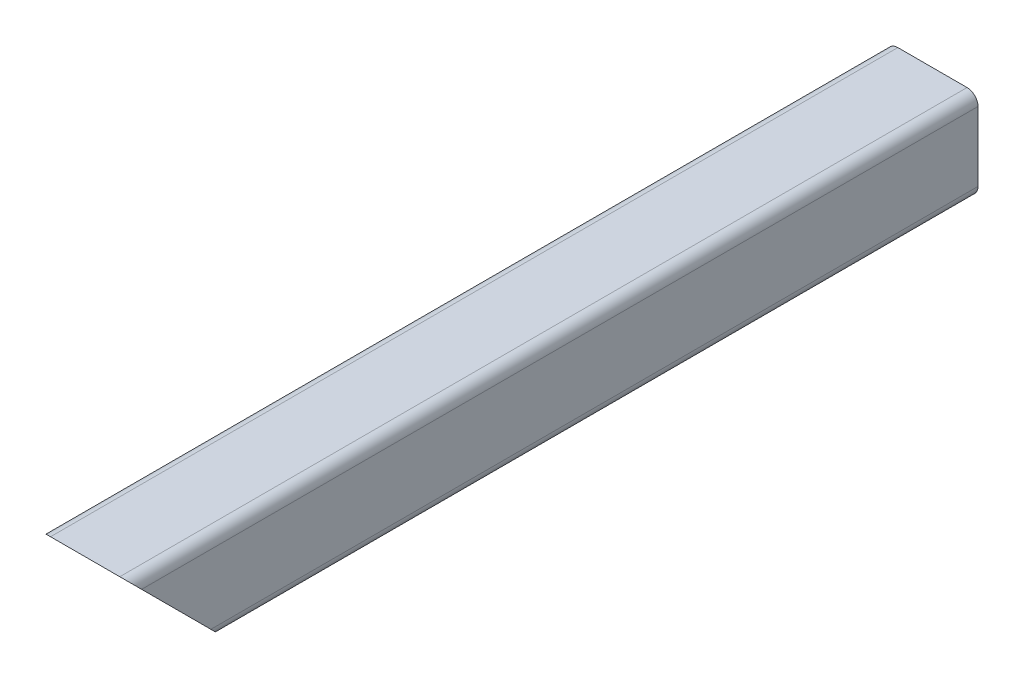
ISO-10303-21;
HEADER;
FILE_DESCRIPTION(('STEP AP214'),'2;1');
FILE_NAME('part.step','',(''),(''),'','','');
FILE_SCHEMA(('AUTOMOTIVE_DESIGN { 1 0 10303 214 1 1 1 1 }'));
ENDSEC;
DATA;
#1=APPLICATION_CONTEXT('core data for automotive mechanical design processes');
#2=APPLICATION_PROTOCOL_DEFINITION('international standard','automotive_design',2000,#1);
#3=PRODUCT_CONTEXT('',#1,'mechanical');
#4=PRODUCT('Part','Part','',(#3));
#5=PRODUCT_RELATED_PRODUCT_CATEGORY('part','',(#4));
#6=PRODUCT_DEFINITION_FORMATION('','',#4);
#7=PRODUCT_DEFINITION_CONTEXT('part definition',#1,'design');
#8=PRODUCT_DEFINITION('design','',#6,#7);
#9=PRODUCT_DEFINITION_SHAPE('','',#8);
#10=(LENGTH_UNIT() NAMED_UNIT(*) SI_UNIT(.MILLI.,.METRE.));
#11=(NAMED_UNIT(*) PLANE_ANGLE_UNIT() SI_UNIT($,.RADIAN.));
#12=(NAMED_UNIT(*) SI_UNIT($,.STERADIAN.) SOLID_ANGLE_UNIT());
#13=UNCERTAINTY_MEASURE_WITH_UNIT(LENGTH_MEASURE(1.E-05),#10,'distance_accuracy_value','');
#14=(GEOMETRIC_REPRESENTATION_CONTEXT(3) GLOBAL_UNCERTAINTY_ASSIGNED_CONTEXT((#13)) GLOBAL_UNIT_ASSIGNED_CONTEXT((#10,
#11,#12)) REPRESENTATION_CONTEXT('',''));
#15=CARTESIAN_POINT('',(0.,0.,0.));
#16=DIRECTION('',(0.,0.,1.));
#17=DIRECTION('',(1.,0.,0.));
#18=AXIS2_PLACEMENT_3D('',#15,#16,#17);
#19=CARTESIAN_POINT('',(0.,0.,0.));
#20=DIRECTION('',(0.,0.,1.));
#21=DIRECTION('',(1.,0.,0.));
#22=AXIS2_PLACEMENT_3D('',#19,#20,#21);
#23=PLANE('',#22);
#24=DIRECTION('',(0.,1.,0.));
#25=VECTOR('',#24,1.);
#26=CARTESIAN_POINT('',(-12.5,-4.75,0.));
#27=LINE('',#26,#25);
#28=CARTESIAN_POINT('',(-12.5,-9.5,0.));
#29=VERTEX_POINT('',#28);
#30=CARTESIAN_POINT('',(-12.5,9.5,0.));
#31=VERTEX_POINT('',#30);
#32=EDGE_CURVE('E186',#29,#31,#27,.T.);
#33=ORIENTED_EDGE('',*,*,#32,.T.);
#34=CARTESIAN_POINT('',(-9.5,9.5,0.));
#35=DIRECTION('',(0.,0.,-1.));
#36=DIRECTION('',(0.,-1.,0.));
#37=AXIS2_PLACEMENT_3D('',#34,#35,#36);
#38=CIRCLE('',#37,3.);
#39=CARTESIAN_POINT('',(-9.5,12.5,0.));
#40=VERTEX_POINT('',#39);
#41=EDGE_CURVE('E272',#31,#40,#38,.T.);
#42=ORIENTED_EDGE('',*,*,#41,.T.);
#43=DIRECTION('',(1.,0.,0.));
#44=VECTOR('',#43,1.);
#45=CARTESIAN_POINT('',(-4.75,12.5,0.));
#46=LINE('',#45,#44);
#47=CARTESIAN_POINT('',(9.5,12.5,0.));
#48=VERTEX_POINT('',#47);
#49=EDGE_CURVE('E11',#40,#48,#46,.T.);
#50=ORIENTED_EDGE('',*,*,#49,.T.);
#51=CARTESIAN_POINT('',(9.5,9.5,0.));
#52=DIRECTION('',(0.,0.,-1.));
#53=DIRECTION('',(-1.,0.,0.));
#54=AXIS2_PLACEMENT_3D('',#51,#52,#53);
#55=CIRCLE('',#54,3.);
#56=CARTESIAN_POINT('',(12.5,9.5,0.));
#57=VERTEX_POINT('',#56);
#58=EDGE_CURVE('E152',#48,#57,#55,.T.);
#59=ORIENTED_EDGE('',*,*,#58,.T.);
#60=DIRECTION('',(0.,-1.,0.));
#61=VECTOR('',#60,1.);
#62=CARTESIAN_POINT('',(12.5,4.75,0.));
#63=LINE('',#62,#61);
#64=CARTESIAN_POINT('',(12.5,-9.5,0.));
#65=VERTEX_POINT('',#64);
#66=EDGE_CURVE('E260',#57,#65,#63,.T.);
#67=ORIENTED_EDGE('',*,*,#66,.T.);
#68=CARTESIAN_POINT('',(9.5,-9.5,0.));
#69=DIRECTION('',(0.,0.,-1.));
#70=DIRECTION('',(0.,1.,0.));
#71=AXIS2_PLACEMENT_3D('',#68,#69,#70);
#72=CIRCLE('',#71,3.);
#73=CARTESIAN_POINT('',(9.5,-12.5,0.));
#74=VERTEX_POINT('',#73);
#75=EDGE_CURVE('E285',#65,#74,#72,.T.);
#76=ORIENTED_EDGE('',*,*,#75,.T.);
#77=DIRECTION('',(-1.,0.,0.));
#78=VECTOR('',#77,1.);
#79=CARTESIAN_POINT('',(4.75,-12.5,0.));
#80=LINE('',#79,#78);
#81=CARTESIAN_POINT('',(-9.5,-12.5,0.));
#82=VERTEX_POINT('',#81);
#83=EDGE_CURVE('E188',#74,#82,#80,.T.);
#84=ORIENTED_EDGE('',*,*,#83,.T.);
#85=CARTESIAN_POINT('',(-9.5,-9.5,0.));
#86=DIRECTION('',(0.,0.,-1.));
#87=DIRECTION('',(1.,0.,0.));
#88=AXIS2_PLACEMENT_3D('',#85,#86,#87);
#89=CIRCLE('',#88,3.);
#90=EDGE_CURVE('E27',#82,#29,#89,.T.);
#91=ORIENTED_EDGE('',*,*,#90,.T.);
#92=EDGE_LOOP('',(#33,#42,#50,#59,#67,#76,#84,#91));
#93=FACE_BOUND('',#92,.T.);
#94=DIRECTION('',(-1.,0.,0.));
#95=VECTOR('',#94,1.);
#96=CARTESIAN_POINT('',(-4.75,10.5,0.));
#97=LINE('',#96,#95);
#98=CARTESIAN_POINT('',(9.5,10.5,0.));
#99=VERTEX_POINT('',#98);
#100=CARTESIAN_POINT('',(-9.5,10.5,0.));
#101=VERTEX_POINT('',#100);
#102=EDGE_CURVE('E120',#99,#101,#97,.T.);
#103=ORIENTED_EDGE('',*,*,#102,.T.);
#104=CARTESIAN_POINT('',(-9.5,9.5,0.));
#105=DIRECTION('',(0.,0.,1.));
#106=DIRECTION('',(0.,-1.,0.));
#107=AXIS2_PLACEMENT_3D('',#104,#105,#106);
#108=CIRCLE('',#107,1.);
#109=CARTESIAN_POINT('',(-10.5,9.5,0.));
#110=VERTEX_POINT('',#109);
#111=EDGE_CURVE('E171',#101,#110,#108,.T.);
#112=ORIENTED_EDGE('',*,*,#111,.T.);
#113=DIRECTION('',(0.,-1.,0.));
#114=VECTOR('',#113,1.);
#115=CARTESIAN_POINT('',(-10.5,-4.75,0.));
#116=LINE('',#115,#114);
#117=CARTESIAN_POINT('',(-10.5,-9.5,0.));
#118=VERTEX_POINT('',#117);
#119=EDGE_CURVE('E249',#110,#118,#116,.T.);
#120=ORIENTED_EDGE('',*,*,#119,.T.);
#121=CARTESIAN_POINT('',(-9.5,-9.5,0.));
#122=DIRECTION('',(0.,0.,1.));
#123=DIRECTION('',(1.,0.,0.));
#124=AXIS2_PLACEMENT_3D('',#121,#122,#123);
#125=CIRCLE('',#124,1.);
#126=CARTESIAN_POINT('',(-9.5,-10.5,0.));
#127=VERTEX_POINT('',#126);
#128=EDGE_CURVE('E187',#118,#127,#125,.T.);
#129=ORIENTED_EDGE('',*,*,#128,.T.);
#130=DIRECTION('',(1.,0.,0.));
#131=VECTOR('',#130,1.);
#132=CARTESIAN_POINT('',(4.75,-10.5,0.));
#133=LINE('',#132,#131);
#134=CARTESIAN_POINT('',(9.5,-10.5,0.));
#135=VERTEX_POINT('',#134);
#136=EDGE_CURVE('E281',#127,#135,#133,.T.);
#137=ORIENTED_EDGE('',*,*,#136,.T.);
#138=CARTESIAN_POINT('',(9.5,-9.5,0.));
#139=DIRECTION('',(0.,0.,1.));
#140=DIRECTION('',(0.,1.,0.));
#141=AXIS2_PLACEMENT_3D('',#138,#139,#140);
#142=CIRCLE('',#141,1.);
#143=CARTESIAN_POINT('',(10.5,-9.5,0.));
#144=VERTEX_POINT('',#143);
#145=EDGE_CURVE('E167',#135,#144,#142,.T.);
#146=ORIENTED_EDGE('',*,*,#145,.T.);
#147=DIRECTION('',(0.,1.,0.));
#148=VECTOR('',#147,1.);
#149=CARTESIAN_POINT('',(10.5,4.75,0.));
#150=LINE('',#149,#148);
#151=CARTESIAN_POINT('',(10.5,9.5,0.));
#152=VERTEX_POINT('',#151);
#153=EDGE_CURVE('E166',#144,#152,#150,.T.);
#154=ORIENTED_EDGE('',*,*,#153,.T.);
#155=CARTESIAN_POINT('',(9.5,9.5,0.));
#156=DIRECTION('',(0.,0.,1.));
#157=DIRECTION('',(-1.,0.,0.));
#158=AXIS2_PLACEMENT_3D('',#155,#156,#157);
#159=CIRCLE('',#158,1.);
#160=EDGE_CURVE('E261',#152,#99,#159,.T.);
#161=ORIENTED_EDGE('',*,*,#160,.T.);
#162=EDGE_LOOP('',(#103,#112,#120,#129,#137,#146,#154,#161));
#163=FACE_BOUND('',#162,.T.);
#164=ADVANCED_FACE('F16',(#93,#163),#23,.F.);
#165=CARTESIAN_POINT('',(-9.5,12.5,0.));
#166=DIRECTION('',(0.,1.,0.));
#167=DIRECTION('',(1.,0.,0.));
#168=AXIS2_PLACEMENT_3D('',#165,#166,#167);
#169=PLANE('',#168);
#170=DIRECTION('',(1.,0.,0.));
#171=VECTOR('',#170,1.);
#172=CARTESIAN_POINT('',(-4.75,12.5,232.50000012));
#173=LINE('',#172,#171);
#174=CARTESIAN_POINT('',(-9.5,12.5,232.50000012));
#175=VERTEX_POINT('',#174);
#176=CARTESIAN_POINT('',(9.5,12.5,232.50000012));
#177=VERTEX_POINT('',#176);
#178=EDGE_CURVE('E228',#175,#177,#173,.T.);
#179=ORIENTED_EDGE('',*,*,#178,.T.);
#180=DIRECTION('',(0.,0.,1.));
#181=VECTOR('',#180,1.);
#182=CARTESIAN_POINT('',(9.5,12.5,0.));
#183=LINE('',#182,#181);
#184=EDGE_CURVE('E156',#48,#177,#183,.T.);
#185=ORIENTED_EDGE('',*,*,#184,.F.);
#186=ORIENTED_EDGE('',*,*,#49,.F.);
#187=DIRECTION('',(0.,0.,1.));
#188=VECTOR('',#187,1.);
#189=CARTESIAN_POINT('',(-9.5,12.5,0.));
#190=LINE('',#189,#188);
#191=EDGE_CURVE('E214',#40,#175,#190,.T.);
#192=ORIENTED_EDGE('',*,*,#191,.T.);
#193=EDGE_LOOP('',(#179,#185,#186,#192));
#194=FACE_BOUND('',#193,.T.);
#195=ADVANCED_FACE('F416',(#194),#169,.T.);
#196=CARTESIAN_POINT('',(-9.5,-9.5,0.));
#197=DIRECTION('',(0.,0.,1.));
#198=DIRECTION('',(1.,0.,0.));
#199=AXIS2_PLACEMENT_3D('',#196,#197,#198);
#200=CYLINDRICAL_SURFACE('',#199,3.);
#201=CARTESIAN_POINT('',(-9.5,-9.5,210.500000015342));
#202=DIRECTION('',(0.,0.707106781320614,-0.707106781052481));
#203=DIRECTION('',(0.,0.707106781052481,0.707106781320614));
#204=AXIS2_PLACEMENT_3D('',#201,#202,#203);
#205=ELLIPSE('',#204,4.24264068792368,3.);
#206=CARTESIAN_POINT('',(-9.5,-12.5,207.500000014204));
#207=VERTEX_POINT('',#206);
#208=CARTESIAN_POINT('',(-12.5,-9.5,210.500000015342));
#209=VERTEX_POINT('',#208);
#210=EDGE_CURVE('E162',#207,#209,#205,.T.);
#211=ORIENTED_EDGE('',*,*,#210,.T.);
#212=DIRECTION('',(0.,0.,1.));
#213=VECTOR('',#212,1.);
#214=CARTESIAN_POINT('',(-12.5,-9.5,0.));
#215=LINE('',#214,#213);
#216=EDGE_CURVE('E207',#29,#209,#215,.T.);
#217=ORIENTED_EDGE('',*,*,#216,.F.);
#218=ORIENTED_EDGE('',*,*,#90,.F.);
#219=DIRECTION('',(0.,0.,1.));
#220=VECTOR('',#219,1.);
#221=CARTESIAN_POINT('',(-9.5,-12.5,0.));
#222=LINE('',#221,#220);
#223=EDGE_CURVE('E190',#82,#207,#222,.T.);
#224=ORIENTED_EDGE('',*,*,#223,.T.);
#225=EDGE_LOOP('',(#211,#217,#218,#224));
#226=FACE_BOUND('',#225,.T.);
#227=ADVANCED_FACE('F208',(#226),#200,.T.);
#228=CARTESIAN_POINT('',(9.5,-12.5,0.));
#229=DIRECTION('',(0.,-1.,0.));
#230=DIRECTION('',(0.,0.,-1.));
#231=AXIS2_PLACEMENT_3D('',#228,#229,#230);
#232=PLANE('',#231);
#233=DIRECTION('',(-1.,0.,0.));
#234=VECTOR('',#233,1.);
#235=CARTESIAN_POINT('',(4.74999999999991,-12.5,207.500000014204));
#236=LINE('',#235,#234);
#237=CARTESIAN_POINT('',(9.5,-12.5,207.500000014204));
#238=VERTEX_POINT('',#237);
#239=EDGE_CURVE('E223',#238,#207,#236,.T.);
#240=ORIENTED_EDGE('',*,*,#239,.T.);
#241=ORIENTED_EDGE('',*,*,#223,.F.);
#242=ORIENTED_EDGE('',*,*,#83,.F.);
#243=DIRECTION('',(0.,0.,1.));
#244=VECTOR('',#243,1.);
#245=CARTESIAN_POINT('',(9.5,-12.5,0.));
#246=LINE('',#245,#244);
#247=EDGE_CURVE('E282',#74,#238,#246,.T.);
#248=ORIENTED_EDGE('',*,*,#247,.T.);
#249=EDGE_LOOP('',(#240,#241,#242,#248));
#250=FACE_BOUND('',#249,.T.);
#251=ADVANCED_FACE('F345',(#250),#232,.T.);
#252=CARTESIAN_POINT('',(9.5,-9.5,0.));
#253=DIRECTION('',(0.,0.,1.));
#254=DIRECTION('',(0.,1.,0.));
#255=AXIS2_PLACEMENT_3D('',#252,#253,#254);
#256=CYLINDRICAL_SURFACE('',#255,3.);
#257=CARTESIAN_POINT('',(9.5,-9.5,210.500000015342));
#258=DIRECTION('',(0.,0.707106781320614,-0.707106781052481));
#259=DIRECTION('',(0.,0.707106781052481,0.707106781320614));
#260=AXIS2_PLACEMENT_3D('',#257,#258,#259);
#261=ELLIPSE('',#260,4.24264068792368,3.);
#262=CARTESIAN_POINT('',(12.5,-9.5,210.500000015342));
#263=VERTEX_POINT('',#262);
#264=EDGE_CURVE('E20',#263,#238,#261,.T.);
#265=ORIENTED_EDGE('',*,*,#264,.T.);
#266=ORIENTED_EDGE('',*,*,#247,.F.);
#267=ORIENTED_EDGE('',*,*,#75,.F.);
#268=DIRECTION('',(0.,0.,1.));
#269=VECTOR('',#268,1.);
#270=CARTESIAN_POINT('',(12.5,-9.5,0.));
#271=LINE('',#270,#269);
#272=EDGE_CURVE('E257',#65,#263,#271,.T.);
#273=ORIENTED_EDGE('',*,*,#272,.T.);
#274=EDGE_LOOP('',(#265,#266,#267,#273));
#275=FACE_BOUND('',#274,.T.);
#276=ADVANCED_FACE('F473',(#275),#256,.T.);
#277=CARTESIAN_POINT('',(12.5,9.5,0.));
#278=DIRECTION('',(1.,0.,0.));
#279=DIRECTION('',(0.,1.,0.));
#280=AXIS2_PLACEMENT_3D('',#277,#278,#279);
#281=PLANE('',#280);
#282=DIRECTION('',(0.,-0.707106781052481,-0.707106781320614));
#283=VECTOR('',#282,1.);
#284=CARTESIAN_POINT('',(12.5,-107.625000010373,112.374999967761));
#285=LINE('',#284,#283);
#286=CARTESIAN_POINT('',(12.5,9.5,229.500000022547));
#287=VERTEX_POINT('',#286);
#288=EDGE_CURVE('E176',#287,#263,#285,.T.);
#289=ORIENTED_EDGE('',*,*,#288,.T.);
#290=ORIENTED_EDGE('',*,*,#272,.F.);
#291=ORIENTED_EDGE('',*,*,#66,.F.);
#292=DIRECTION('',(0.,0.,1.));
#293=VECTOR('',#292,1.);
#294=CARTESIAN_POINT('',(12.5,9.5,0.));
#295=LINE('',#294,#293);
#296=EDGE_CURVE('E157',#57,#287,#295,.T.);
#297=ORIENTED_EDGE('',*,*,#296,.T.);
#298=EDGE_LOOP('',(#289,#290,#291,#297));
#299=FACE_BOUND('',#298,.T.);
#300=ADVANCED_FACE('F407',(#299),#281,.T.);
#301=CARTESIAN_POINT('',(9.5,9.5,0.));
#302=DIRECTION('',(0.,0.,1.));
#303=DIRECTION('',(-1.,0.,0.));
#304=AXIS2_PLACEMENT_3D('',#301,#302,#303);
#305=CYLINDRICAL_SURFACE('',#304,1.);
#306=CARTESIAN_POINT('',(9.5,9.5,229.500000022547));
#307=DIRECTION('',(0.,-0.707106781320614,0.707106781052481));
#308=DIRECTION('',(0.,-0.707106781052481,-0.707106781320614));
#309=AXIS2_PLACEMENT_3D('',#306,#307,#308);
#310=ELLIPSE('',#309,1.41421356264123,1.);
#311=CARTESIAN_POINT('',(10.5,9.5,229.500000022547));
#312=VERTEX_POINT('',#311);
#313=CARTESIAN_POINT('',(9.5,10.5,230.500000022926));
#314=VERTEX_POINT('',#313);
#315=EDGE_CURVE('E126',#312,#314,#310,.T.);
#316=ORIENTED_EDGE('',*,*,#315,.T.);
#317=DIRECTION('',(0.,0.,1.));
#318=VECTOR('',#317,1.);
#319=CARTESIAN_POINT('',(9.5,10.5,0.));
#320=LINE('',#319,#318);
#321=EDGE_CURVE('E112',#99,#314,#320,.T.);
#322=ORIENTED_EDGE('',*,*,#321,.F.);
#323=ORIENTED_EDGE('',*,*,#160,.F.);
#324=DIRECTION('',(0.,0.,1.));
#325=VECTOR('',#324,1.);
#326=CARTESIAN_POINT('',(10.5,9.5,0.));
#327=LINE('',#326,#325);
#328=EDGE_CURVE('E128',#152,#312,#327,.T.);
#329=ORIENTED_EDGE('',*,*,#328,.T.);
#330=EDGE_LOOP('',(#316,#322,#323,#329));
#331=FACE_BOUND('',#330,.T.);
#332=ADVANCED_FACE('F18',(#331),#305,.F.);
#333=CARTESIAN_POINT('',(10.5,9.5,0.));
#334=DIRECTION('',(1.,0.,0.));
#335=DIRECTION('',(0.,-1.,0.));
#336=AXIS2_PLACEMENT_3D('',#333,#334,#335);
#337=PLANE('',#336);
#338=DIRECTION('',(0.,0.707106781052481,0.707106781320614));
#339=VECTOR('',#338,1.);
#340=CARTESIAN_POINT('',(10.5,-107.625000010373,112.374999967761));
#341=LINE('',#340,#339);
#342=CARTESIAN_POINT('',(10.5,-9.5,210.500000015342));
#343=VERTEX_POINT('',#342);
#344=EDGE_CURVE('E133',#343,#312,#341,.T.);
#345=ORIENTED_EDGE('',*,*,#344,.T.);
#346=ORIENTED_EDGE('',*,*,#328,.F.);
#347=ORIENTED_EDGE('',*,*,#153,.F.);
#348=DIRECTION('',(0.,0.,1.));
#349=VECTOR('',#348,1.);
#350=CARTESIAN_POINT('',(10.5,-9.5,0.));
#351=LINE('',#350,#349);
#352=EDGE_CURVE('E150',#144,#343,#351,.T.);
#353=ORIENTED_EDGE('',*,*,#352,.T.);
#354=EDGE_LOOP('',(#345,#346,#347,#353));
#355=FACE_BOUND('',#354,.T.);
#356=ADVANCED_FACE('F317',(#355),#337,.F.);
#357=CARTESIAN_POINT('',(9.5,-9.5,0.));
#358=DIRECTION('',(0.,0.,1.));
#359=DIRECTION('',(0.,1.,0.));
#360=AXIS2_PLACEMENT_3D('',#357,#358,#359);
#361=CYLINDRICAL_SURFACE('',#360,1.);
#362=CARTESIAN_POINT('',(9.5,-9.5,210.500000015342));
#363=DIRECTION('',(0.,-0.707106781320614,0.707106781052481));
#364=DIRECTION('',(0.,0.707106781052481,0.707106781320614));
#365=AXIS2_PLACEMENT_3D('',#362,#363,#364);
#366=ELLIPSE('',#365,1.41421356264123,1.);
#367=CARTESIAN_POINT('',(9.5,-10.5,209.500000014963));
#368=VERTEX_POINT('',#367);
#369=EDGE_CURVE('E181',#368,#343,#366,.T.);
#370=ORIENTED_EDGE('',*,*,#369,.T.);
#371=ORIENTED_EDGE('',*,*,#352,.F.);
#372=ORIENTED_EDGE('',*,*,#145,.F.);
#373=DIRECTION('',(0.,0.,1.));
#374=VECTOR('',#373,1.);
#375=CARTESIAN_POINT('',(9.5,-10.5,0.));
#376=LINE('',#375,#374);
#377=EDGE_CURVE('E256',#135,#368,#376,.T.);
#378=ORIENTED_EDGE('',*,*,#377,.T.);
#379=EDGE_LOOP('',(#370,#371,#372,#378));
#380=FACE_BOUND('',#379,.T.);
#381=ADVANCED_FACE('F323',(#380),#361,.F.);
#382=CARTESIAN_POINT('',(9.5,-10.5,0.));
#383=DIRECTION('',(0.,-1.,0.));
#384=DIRECTION('',(0.,0.,-1.));
#385=AXIS2_PLACEMENT_3D('',#382,#383,#384);
#386=PLANE('',#385);
#387=DIRECTION('',(1.,0.,0.));
#388=VECTOR('',#387,1.);
#389=CARTESIAN_POINT('',(4.75,-10.5,209.500000014963));
#390=LINE('',#389,#388);
#391=CARTESIAN_POINT('',(-9.5,-10.5,209.500000014963));
#392=VERTEX_POINT('',#391);
#393=EDGE_CURVE('E262',#392,#368,#390,.T.);
#394=ORIENTED_EDGE('',*,*,#393,.T.);
#395=ORIENTED_EDGE('',*,*,#377,.F.);
#396=ORIENTED_EDGE('',*,*,#136,.F.);
#397=DIRECTION('',(0.,0.,1.));
#398=VECTOR('',#397,1.);
#399=CARTESIAN_POINT('',(-9.5,-10.5,0.));
#400=LINE('',#399,#398);
#401=EDGE_CURVE('E253',#127,#392,#400,.T.);
#402=ORIENTED_EDGE('',*,*,#401,.T.);
#403=EDGE_LOOP('',(#394,#395,#396,#402));
#404=FACE_BOUND('',#403,.T.);
#405=ADVANCED_FACE('F479',(#404),#386,.F.);
#406=CARTESIAN_POINT('',(9.5,9.5,0.));
#407=DIRECTION('',(0.,0.,1.));
#408=DIRECTION('',(-1.,0.,0.));
#409=AXIS2_PLACEMENT_3D('',#406,#407,#408);
#410=CYLINDRICAL_SURFACE('',#409,3.);
#411=CARTESIAN_POINT('',(9.5,9.5,229.500000022547));
#412=DIRECTION('',(0.,0.707106781320614,-0.707106781052481));
#413=DIRECTION('',(0.,-0.707106781052481,-0.707106781320614));
#414=AXIS2_PLACEMENT_3D('',#411,#412,#413);
#415=ELLIPSE('',#414,4.24264068792368,3.);
#416=EDGE_CURVE('E180',#177,#287,#415,.T.);
#417=ORIENTED_EDGE('',*,*,#416,.T.);
#418=ORIENTED_EDGE('',*,*,#296,.F.);
#419=ORIENTED_EDGE('',*,*,#58,.F.);
#420=ORIENTED_EDGE('',*,*,#184,.T.);
#421=EDGE_LOOP('',(#417,#418,#419,#420));
#422=FACE_BOUND('',#421,.T.);
#423=ADVANCED_FACE('F484',(#422),#410,.T.);
#424=CARTESIAN_POINT('',(-9.5,9.5,0.));
#425=DIRECTION('',(0.,0.,1.));
#426=DIRECTION('',(0.,-1.,0.));
#427=AXIS2_PLACEMENT_3D('',#424,#425,#426);
#428=CYLINDRICAL_SURFACE('',#427,3.);
#429=CARTESIAN_POINT('',(-9.5,9.5,229.500000022547));
#430=DIRECTION('',(0.,0.707106781320614,-0.707106781052481));
#431=DIRECTION('',(0.,-0.707106781052481,-0.707106781320614));
#432=AXIS2_PLACEMENT_3D('',#429,#430,#431);
#433=ELLIPSE('',#432,4.24264068792368,3.);
#434=CARTESIAN_POINT('',(-12.5,9.5,229.500000022547));
#435=VERTEX_POINT('',#434);
#436=EDGE_CURVE('E163',#435,#175,#433,.T.);
#437=ORIENTED_EDGE('',*,*,#436,.T.);
#438=ORIENTED_EDGE('',*,*,#191,.F.);
#439=ORIENTED_EDGE('',*,*,#41,.F.);
#440=DIRECTION('',(0.,0.,1.));
#441=VECTOR('',#440,1.);
#442=CARTESIAN_POINT('',(-12.5,9.5,0.));
#443=LINE('',#442,#441);
#444=EDGE_CURVE('E182',#31,#435,#443,.T.);
#445=ORIENTED_EDGE('',*,*,#444,.T.);
#446=EDGE_LOOP('',(#437,#438,#439,#445));
#447=FACE_BOUND('',#446,.T.);
#448=ADVANCED_FACE('F496',(#447),#428,.T.);
#449=CARTESIAN_POINT('',(-12.5,-9.5,0.));
#450=DIRECTION('',(-1.,0.,0.));
#451=DIRECTION('',(0.,1.,0.));
#452=AXIS2_PLACEMENT_3D('',#449,#450,#451);
#453=PLANE('',#452);
#454=DIRECTION('',(0.,0.707106781052481,0.707106781320614));
#455=VECTOR('',#454,1.);
#456=CARTESIAN_POINT('',(-12.5,-112.375000008572,107.624999967761));
#457=LINE('',#456,#455);
#458=EDGE_CURVE('E158',#209,#435,#457,.T.);
#459=ORIENTED_EDGE('',*,*,#458,.T.);
#460=ORIENTED_EDGE('',*,*,#444,.F.);
#461=ORIENTED_EDGE('',*,*,#32,.F.);
#462=ORIENTED_EDGE('',*,*,#216,.T.);
#463=EDGE_LOOP('',(#459,#460,#461,#462));
#464=FACE_BOUND('',#463,.T.);
#465=ADVANCED_FACE('F216',(#464),#453,.T.);
#466=CARTESIAN_POINT('',(-9.5,-9.5,0.));
#467=DIRECTION('',(0.,0.,1.));
#468=DIRECTION('',(1.,0.,0.));
#469=AXIS2_PLACEMENT_3D('',#466,#467,#468);
#470=CYLINDRICAL_SURFACE('',#469,1.);
#471=CARTESIAN_POINT('',(-9.5,-9.5,210.500000015342));
#472=DIRECTION('',(0.,-0.707106781320614,0.707106781052481));
#473=DIRECTION('',(0.,0.707106781052481,0.707106781320614));
#474=AXIS2_PLACEMENT_3D('',#471,#472,#473);
#475=ELLIPSE('',#474,1.41421356264123,1.);
#476=CARTESIAN_POINT('',(-10.5,-9.5,210.500000015342));
#477=VERTEX_POINT('',#476);
#478=EDGE_CURVE('E266',#477,#392,#475,.T.);
#479=ORIENTED_EDGE('',*,*,#478,.T.);
#480=ORIENTED_EDGE('',*,*,#401,.F.);
#481=ORIENTED_EDGE('',*,*,#128,.F.);
#482=DIRECTION('',(0.,0.,1.));
#483=VECTOR('',#482,1.);
#484=CARTESIAN_POINT('',(-10.5,-9.5,0.));
#485=LINE('',#484,#483);
#486=EDGE_CURVE('E175',#118,#477,#485,.T.);
#487=ORIENTED_EDGE('',*,*,#486,.T.);
#488=EDGE_LOOP('',(#479,#480,#481,#487));
#489=FACE_BOUND('',#488,.T.);
#490=ADVANCED_FACE('F420',(#489),#470,.F.);
#491=CARTESIAN_POINT('',(-10.5,-9.5,0.));
#492=DIRECTION('',(-1.,0.,0.));
#493=DIRECTION('',(0.,0.,1.));
#494=AXIS2_PLACEMENT_3D('',#491,#492,#493);
#495=PLANE('',#494);
#496=DIRECTION('',(0.,-0.707106781052481,-0.707106781320614));
#497=VECTOR('',#496,1.);
#498=CARTESIAN_POINT('',(-10.5,-112.375000008572,107.624999967761));
#499=LINE('',#498,#497);
#500=CARTESIAN_POINT('',(-10.5,9.5,229.500000022547));
#501=VERTEX_POINT('',#500);
#502=EDGE_CURVE('E146',#501,#477,#499,.T.);
#503=ORIENTED_EDGE('',*,*,#502,.T.);
#504=ORIENTED_EDGE('',*,*,#486,.F.);
#505=ORIENTED_EDGE('',*,*,#119,.F.);
#506=DIRECTION('',(0.,0.,1.));
#507=VECTOR('',#506,1.);
#508=CARTESIAN_POINT('',(-10.5,9.5,0.));
#509=LINE('',#508,#507);
#510=EDGE_CURVE('E123',#110,#501,#509,.T.);
#511=ORIENTED_EDGE('',*,*,#510,.T.);
#512=EDGE_LOOP('',(#503,#504,#505,#511));
#513=FACE_BOUND('',#512,.T.);
#514=ADVANCED_FACE('F425',(#513),#495,.F.);
#515=CARTESIAN_POINT('',(-9.5,9.5,0.));
#516=DIRECTION('',(0.,0.,1.));
#517=DIRECTION('',(0.,-1.,0.));
#518=AXIS2_PLACEMENT_3D('',#515,#516,#517);
#519=CYLINDRICAL_SURFACE('',#518,1.);
#520=CARTESIAN_POINT('',(-9.5,9.5,229.500000022547));
#521=DIRECTION('',(0.,-0.707106781320614,0.707106781052481));
#522=DIRECTION('',(0.,-0.707106781052481,-0.707106781320614));
#523=AXIS2_PLACEMENT_3D('',#520,#521,#522);
#524=ELLIPSE('',#523,1.41421356264123,1.);
#525=CARTESIAN_POINT('',(-9.5,10.5,230.500000022926));
#526=VERTEX_POINT('',#525);
#527=EDGE_CURVE('E139',#526,#501,#524,.T.);
#528=ORIENTED_EDGE('',*,*,#527,.T.);
#529=ORIENTED_EDGE('',*,*,#510,.F.);
#530=ORIENTED_EDGE('',*,*,#111,.F.);
#531=DIRECTION('',(0.,0.,1.));
#532=VECTOR('',#531,1.);
#533=CARTESIAN_POINT('',(-9.5,10.5,0.));
#534=LINE('',#533,#532);
#535=EDGE_CURVE('E225',#101,#526,#534,.T.);
#536=ORIENTED_EDGE('',*,*,#535,.T.);
#537=EDGE_LOOP('',(#528,#529,#530,#536));
#538=FACE_BOUND('',#537,.T.);
#539=ADVANCED_FACE('F435',(#538),#519,.F.);
#540=CARTESIAN_POINT('',(-9.5,10.5,0.));
#541=DIRECTION('',(0.,1.,0.));
#542=DIRECTION('',(1.,0.,0.));
#543=AXIS2_PLACEMENT_3D('',#540,#541,#542);
#544=PLANE('',#543);
#545=DIRECTION('',(-1.,0.,0.));
#546=VECTOR('',#545,1.);
#547=CARTESIAN_POINT('',(-4.75,10.5,230.500000022926));
#548=LINE('',#547,#546);
#549=EDGE_CURVE('E117',#314,#526,#548,.T.);
#550=ORIENTED_EDGE('',*,*,#549,.T.);
#551=ORIENTED_EDGE('',*,*,#535,.F.);
#552=ORIENTED_EDGE('',*,*,#102,.F.);
#553=ORIENTED_EDGE('',*,*,#321,.T.);
#554=EDGE_LOOP('',(#550,#551,#552,#553));
#555=FACE_BOUND('',#554,.T.);
#556=ADVANCED_FACE('F114',(#555),#544,.F.);
#557=CARTESIAN_POINT('',(0.,-110.000000009472,109.999999967761));
#558=DIRECTION('',(0.,0.707106781320614,-0.707106781052481));
#559=DIRECTION('',(-1.,0.,0.));
#560=AXIS2_PLACEMENT_3D('',#557,#558,#559);
#561=PLANE('',#560);
#562=ORIENTED_EDGE('',*,*,#288,.F.);
#563=ORIENTED_EDGE('',*,*,#416,.F.);
#564=ORIENTED_EDGE('',*,*,#178,.F.);
#565=ORIENTED_EDGE('',*,*,#436,.F.);
#566=ORIENTED_EDGE('',*,*,#458,.F.);
#567=ORIENTED_EDGE('',*,*,#210,.F.);
#568=ORIENTED_EDGE('',*,*,#239,.F.);
#569=ORIENTED_EDGE('',*,*,#264,.F.);
#570=EDGE_LOOP('',(#562,#563,#564,#565,#566,#567,#568,#569));
#571=FACE_BOUND('',#570,.T.);
#572=ORIENTED_EDGE('',*,*,#393,.F.);
#573=ORIENTED_EDGE('',*,*,#478,.F.);
#574=ORIENTED_EDGE('',*,*,#502,.F.);
#575=ORIENTED_EDGE('',*,*,#527,.F.);
#576=ORIENTED_EDGE('',*,*,#549,.F.);
#577=ORIENTED_EDGE('',*,*,#315,.F.);
#578=ORIENTED_EDGE('',*,*,#344,.F.);
#579=ORIENTED_EDGE('',*,*,#369,.F.);
#580=EDGE_LOOP('',(#572,#573,#574,#575,#576,#577,#578,#579));
#581=FACE_BOUND('',#580,.T.);
#582=ADVANCED_FACE('F136',(#571,#581),#561,.F.);
#583=CLOSED_SHELL('',(#164,#195,#227,#251,#276,#300,#332,#356,#381,#405,#423,#448,#465,#490,
#514,#539,#556,#582));
#584=MANIFOLD_SOLID_BREP('B1',#583);
#585=ADVANCED_BREP_SHAPE_REPRESENTATION('',(#18,#584),#14);
#586=SHAPE_DEFINITION_REPRESENTATION(#9,#585);
ENDSEC;
END-ISO-10303-21;
